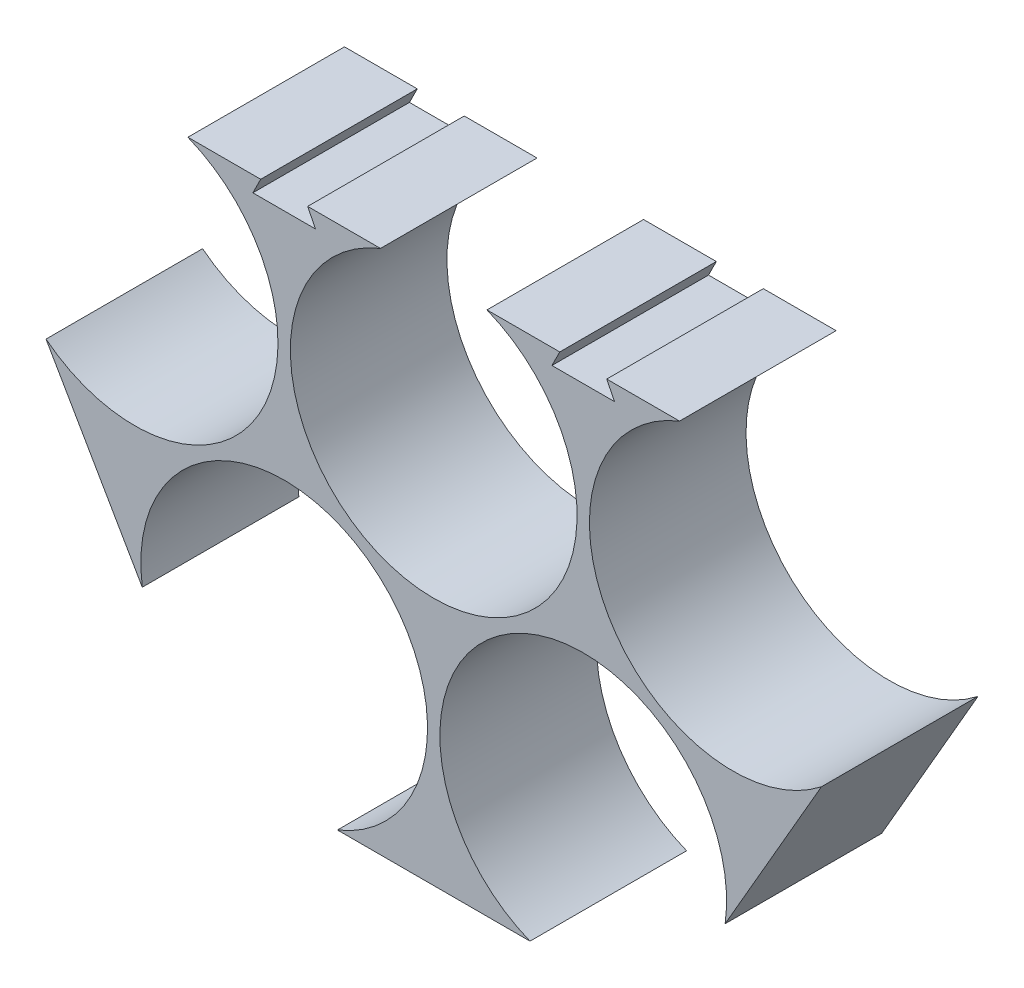
ISO-10303-21;
HEADER;
FILE_DESCRIPTION(('STEP AP214'),'2;1');
FILE_NAME('part.step','',(''),(''),'','','');
FILE_SCHEMA(('AUTOMOTIVE_DESIGN { 1 0 10303 214 1 1 1 1 }'));
ENDSEC;
DATA;
#1=APPLICATION_CONTEXT('core data for automotive mechanical design processes');
#2=APPLICATION_PROTOCOL_DEFINITION('international standard','automotive_design',2000,#1);
#3=PRODUCT_CONTEXT('',#1,'mechanical');
#4=PRODUCT('Part','Part','',(#3));
#5=PRODUCT_RELATED_PRODUCT_CATEGORY('part','',(#4));
#6=PRODUCT_DEFINITION_FORMATION('','',#4);
#7=PRODUCT_DEFINITION_CONTEXT('part definition',#1,'design');
#8=PRODUCT_DEFINITION('design','',#6,#7);
#9=PRODUCT_DEFINITION_SHAPE('','',#8);
#10=(LENGTH_UNIT() NAMED_UNIT(*) SI_UNIT(.MILLI.,.METRE.));
#11=(NAMED_UNIT(*) PLANE_ANGLE_UNIT() SI_UNIT($,.RADIAN.));
#12=(NAMED_UNIT(*) SI_UNIT($,.STERADIAN.) SOLID_ANGLE_UNIT());
#13=UNCERTAINTY_MEASURE_WITH_UNIT(LENGTH_MEASURE(1.E-05),#10,'distance_accuracy_value','');
#14=(GEOMETRIC_REPRESENTATION_CONTEXT(3) GLOBAL_UNCERTAINTY_ASSIGNED_CONTEXT((#13)) GLOBAL_UNIT_ASSIGNED_CONTEXT((#10,
#11,#12)) REPRESENTATION_CONTEXT('',''));
#15=CARTESIAN_POINT('',(0.,0.,0.));
#16=DIRECTION('',(0.,0.,1.));
#17=DIRECTION('',(1.,0.,0.));
#18=AXIS2_PLACEMENT_3D('',#15,#16,#17);
#19=CARTESIAN_POINT('',(0.,1.34473536281053,10.));
#20=DIRECTION('',(0.,1.,0.));
#21=DIRECTION('',(-1.,0.,0.));
#22=AXIS2_PLACEMENT_3D('',#19,#20,#21);
#23=PLANE('',#22);
#24=DIRECTION('',(1.,0.,0.));
#25=VECTOR('',#24,1.);
#26=CARTESIAN_POINT('',(0.,1.34473536281053,0.));
#27=LINE('',#26,#25);
#28=CARTESIAN_POINT('',(-11.4971994161277,1.34473536281053,0.));
#29=VERTEX_POINT('',#28);
#30=CARTESIAN_POINT('',(-6.84779127637798,1.34473536281053,0.));
#31=VERTEX_POINT('',#30);
#32=EDGE_CURVE('E289',#29,#31,#27,.T.);
#33=ORIENTED_EDGE('',*,*,#32,.F.);
#34=DIRECTION('',(0.,0.,-1.));
#35=VECTOR('',#34,1.);
#36=CARTESIAN_POINT('',(-11.4971994161277,1.34473536281053,10.));
#37=LINE('',#36,#35);
#38=CARTESIAN_POINT('',(-11.4971994161277,1.34473536281053,10.));
#39=VERTEX_POINT('',#38);
#40=EDGE_CURVE('E207',#39,#29,#37,.T.);
#41=ORIENTED_EDGE('',*,*,#40,.F.);
#42=DIRECTION('',(1.,0.,0.));
#43=VECTOR('',#42,1.);
#44=CARTESIAN_POINT('',(0.,1.34473536281053,10.));
#45=LINE('',#44,#43);
#46=CARTESIAN_POINT('',(-6.84779127637798,1.34473536281053,10.));
#47=VERTEX_POINT('',#46);
#48=EDGE_CURVE('E248',#39,#47,#45,.T.);
#49=ORIENTED_EDGE('',*,*,#48,.T.);
#50=DIRECTION('',(0.,0.,-1.));
#51=VECTOR('',#50,1.);
#52=CARTESIAN_POINT('',(-6.84779127637798,1.34473536281053,10.));
#53=LINE('',#52,#51);
#54=EDGE_CURVE('E11',#47,#31,#53,.T.);
#55=ORIENTED_EDGE('',*,*,#54,.T.);
#56=EDGE_LOOP('',(#33,#41,#49,#55));
#57=FACE_BOUND('',#56,.T.);
#58=ADVANCED_FACE('F41',(#57),#23,.T.);
#59=CARTESIAN_POINT('',(0.,1.34473536281053,10.));
#60=DIRECTION('',(0.,1.,0.));
#61=DIRECTION('',(-1.,0.,0.));
#62=AXIS2_PLACEMENT_3D('',#59,#60,#61);
#63=PLANE('',#62);
#64=DIRECTION('',(1.,0.,0.));
#65=VECTOR('',#64,1.);
#66=CARTESIAN_POINT('',(0.,1.34473536281053,0.));
#67=LINE('',#66,#65);
#68=CARTESIAN_POINT('',(-30.5971994161277,1.34473536281053,0.));
#69=VERTEX_POINT('',#68);
#70=CARTESIAN_POINT('',(-25.9477912763779,1.34473536281053,0.));
#71=VERTEX_POINT('',#70);
#72=EDGE_CURVE('E298',#69,#71,#67,.T.);
#73=ORIENTED_EDGE('',*,*,#72,.F.);
#74=DIRECTION('',(0.,0.,-1.));
#75=VECTOR('',#74,1.);
#76=CARTESIAN_POINT('',(-30.5971994161277,1.34473536281053,10.));
#77=LINE('',#76,#75);
#78=CARTESIAN_POINT('',(-30.5971994161277,1.34473536281053,10.));
#79=VERTEX_POINT('',#78);
#80=EDGE_CURVE('E200',#79,#69,#77,.T.);
#81=ORIENTED_EDGE('',*,*,#80,.F.);
#82=DIRECTION('',(1.,0.,0.));
#83=VECTOR('',#82,1.);
#84=CARTESIAN_POINT('',(0.,1.34473536281053,10.));
#85=LINE('',#84,#83);
#86=CARTESIAN_POINT('',(-25.9477912763779,1.34473536281053,10.));
#87=VERTEX_POINT('',#86);
#88=EDGE_CURVE('E257',#79,#87,#85,.T.);
#89=ORIENTED_EDGE('',*,*,#88,.T.);
#90=DIRECTION('',(0.,0.,-1.));
#91=VECTOR('',#90,1.);
#92=CARTESIAN_POINT('',(-25.9477912763779,1.34473536281053,10.));
#93=LINE('',#92,#91);
#94=EDGE_CURVE('E346',#87,#71,#93,.T.);
#95=ORIENTED_EDGE('',*,*,#94,.T.);
#96=EDGE_LOOP('',(#73,#81,#89,#95));
#97=FACE_BOUND('',#96,.T.);
#98=ADVANCED_FACE('F365',(#97),#63,.T.);
#99=CARTESIAN_POINT('',(0.,0.,10.));
#100=DIRECTION('',(0.,0.,1.));
#101=DIRECTION('',(1.,0.,0.));
#102=AXIS2_PLACEMENT_3D('',#99,#100,#101);
#103=PLANE('',#102);
#104=ORIENTED_EDGE('',*,*,#48,.F.);
#105=DIRECTION('',(-0.447213595499958,0.894427190999916,0.));
#106=VECTOR('',#105,1.);
#107=CARTESIAN_POINT('',(-8.65986538777798,-4.32993269388899,10.));
#108=LINE('',#107,#106);
#109=CARTESIAN_POINT('',(-10.9971994161277,0.344735362810525,10.));
#110=VERTEX_POINT('',#109);
#111=EDGE_CURVE('E175',#110,#39,#108,.T.);
#112=ORIENTED_EDGE('',*,*,#111,.F.);
#113=DIRECTION('',(-1.,0.,0.));
#114=VECTOR('',#113,1.);
#115=CARTESIAN_POINT('',(0.,0.344735362810523,10.));
#116=LINE('',#115,#114);
#117=CARTESIAN_POINT('',(-14.9971994161277,0.344735362810526,10.));
#118=VERTEX_POINT('',#117);
#119=EDGE_CURVE('E169',#110,#118,#116,.T.);
#120=ORIENTED_EDGE('',*,*,#119,.T.);
#121=DIRECTION('',(0.447213595499958,0.894427190999916,0.));
#122=VECTOR('',#121,1.);
#123=CARTESIAN_POINT('',(-12.1356536780264,6.0678268390132,10.));
#124=LINE('',#123,#122);
#125=CARTESIAN_POINT('',(-14.4971994161277,1.34473536281053,10.));
#126=VERTEX_POINT('',#125);
#127=EDGE_CURVE('E178',#118,#126,#124,.T.);
#128=ORIENTED_EDGE('',*,*,#127,.T.);
#129=CARTESIAN_POINT('',(-19.1466075558775,1.34473536281052,10.));
#130=VERTEX_POINT('',#129);
#131=EDGE_CURVE('E250',#130,#126,#45,.T.);
#132=ORIENTED_EDGE('',*,*,#131,.F.);
#133=CARTESIAN_POINT('',(-22.5471994161277,-7.15526463718948,10.));
#134=DIRECTION('',(0.,0.,1.));
#135=DIRECTION('',(1.,0.,0.));
#136=AXIS2_PLACEMENT_3D('',#133,#134,#135);
#137=CIRCLE('',#136,9.155);
#138=EDGE_CURVE('E253',#87,#130,#137,.T.);
#139=ORIENTED_EDGE('',*,*,#138,.F.);
#140=ORIENTED_EDGE('',*,*,#88,.F.);
#141=DIRECTION('',(-0.447213595499958,0.894427190999916,0.));
#142=VECTOR('',#141,1.);
#143=CARTESIAN_POINT('',(-23.9398653877779,-11.969932693889,10.));
#144=LINE('',#143,#142);
#145=CARTESIAN_POINT('',(-30.0971994161277,0.344735362810526,10.));
#146=VERTEX_POINT('',#145);
#147=EDGE_CURVE('E212',#146,#79,#144,.T.);
#148=ORIENTED_EDGE('',*,*,#147,.F.);
#149=DIRECTION('',(-1.,0.,0.));
#150=VECTOR('',#149,1.);
#151=CARTESIAN_POINT('',(0.,0.344735362810526,10.));
#152=LINE('',#151,#150);
#153=CARTESIAN_POINT('',(-34.0971994161277,0.344735362810526,10.));
#154=VERTEX_POINT('',#153);
#155=EDGE_CURVE('E215',#146,#154,#152,.T.);
#156=ORIENTED_EDGE('',*,*,#155,.T.);
#157=DIRECTION('',(0.447213595499958,0.894427190999916,0.));
#158=VECTOR('',#157,1.);
#159=CARTESIAN_POINT('',(-27.4156536780263,13.7078268390132,10.));
#160=LINE('',#159,#158);
#161=CARTESIAN_POINT('',(-33.5971994161277,1.34473536281053,10.));
#162=VERTEX_POINT('',#161);
#163=EDGE_CURVE('E220',#154,#162,#160,.T.);
#164=ORIENTED_EDGE('',*,*,#163,.T.);
#165=CARTESIAN_POINT('',(-38.2466075558774,1.34473536281052,10.));
#166=VERTEX_POINT('',#165);
#167=EDGE_CURVE('E258',#166,#162,#85,.T.);
#168=ORIENTED_EDGE('',*,*,#167,.F.);
#169=CARTESIAN_POINT('',(-41.6471994161276,-7.15526463718948,10.));
#170=DIRECTION('',(0.,0.,1.));
#171=DIRECTION('',(1.,0.,0.));
#172=AXIS2_PLACEMENT_3D('',#169,#170,#171);
#173=CIRCLE('',#172,9.15499999999999);
#174=CARTESIAN_POINT('',(-47.3081194181702,-14.3502635760687,10.));
#175=VERTEX_POINT('',#174);
#176=EDGE_CURVE('E262',#175,#166,#173,.T.);
#177=ORIENTED_EDGE('',*,*,#176,.F.);
#178=DIRECTION('',(-0.499999999999998,0.86602540378444,0.));
#179=VECTOR('',#178,1.);
#180=CARTESIAN_POINT('',(-41.6949359675668,-24.0725825047188,10.));
#181=LINE('',#180,#179);
#182=CARTESIAN_POINT('',(-41.1587112784205,-25.001350910593,10.));
#183=VERTEX_POINT('',#182);
#184=EDGE_CURVE('E266',#183,#175,#181,.T.);
#185=ORIENTED_EDGE('',*,*,#184,.F.);
#186=CARTESIAN_POINT('',(-32.0971994161277,-23.6963498494723,10.));
#187=DIRECTION('',(0.,0.,1.));
#188=DIRECTION('',(1.,0.,0.));
#189=AXIS2_PLACEMENT_3D('',#186,#187,#188);
#190=CIRCLE('',#189,9.15500000000001);
#191=CARTESIAN_POINT('',(-28.6966075558775,-32.1963498494723,10.));
#192=VERTEX_POINT('',#191);
#193=EDGE_CURVE('E270',#192,#183,#190,.T.);
#194=ORIENTED_EDGE('',*,*,#193,.F.);
#195=DIRECTION('',(-1.,0.,0.));
#196=VECTOR('',#195,1.);
#197=CARTESIAN_POINT('',(0.,-32.1963498494723,10.));
#198=LINE('',#197,#196);
#199=CARTESIAN_POINT('',(-16.3977912763779,-32.1963498494723,10.));
#200=VERTEX_POINT('',#199);
#201=EDGE_CURVE('E274',#200,#192,#198,.T.);
#202=ORIENTED_EDGE('',*,*,#201,.F.);
#203=CARTESIAN_POINT('',(-12.9971994161277,-23.6963498494723,10.));
#204=DIRECTION('',(0.,0.,1.));
#205=DIRECTION('',(1.,0.,0.));
#206=AXIS2_PLACEMENT_3D('',#203,#204,#205);
#207=CIRCLE('',#206,9.15500000000002);
#208=CARTESIAN_POINT('',(-3.9356875538349,-25.001350910593,10.));
#209=VERTEX_POINT('',#208);
#210=EDGE_CURVE('E278',#209,#200,#207,.T.);
#211=ORIENTED_EDGE('',*,*,#210,.F.);
#212=DIRECTION('',(0.499999999999998,0.86602540378444,0.));
#213=VECTOR('',#212,1.);
#214=CARTESIAN_POINT('',(7.87413684337514,-4.54613502615856,10.));
#215=LINE('',#214,#213);
#216=CARTESIAN_POINT('',(2.21372058591484,-14.3502635760687,10.));
#217=VERTEX_POINT('',#216);
#218=EDGE_CURVE('E282',#209,#217,#215,.T.);
#219=ORIENTED_EDGE('',*,*,#218,.T.);
#220=CARTESIAN_POINT('',(-3.44719941612778,-7.15526463718948,10.));
#221=DIRECTION('',(0.,0.,1.));
#222=DIRECTION('',(1.,0.,0.));
#223=AXIS2_PLACEMENT_3D('',#220,#221,#222);
#224=CIRCLE('',#223,9.15499999999999);
#225=EDGE_CURVE('E244',#47,#217,#224,.T.);
#226=ORIENTED_EDGE('',*,*,#225,.F.);
#227=EDGE_LOOP('',(#104,#112,#120,#128,#132,#139,#140,#148,#156,#164,#168,#177,#185,#194,#202,
#211,#219,#226));
#228=FACE_BOUND('',#227,.T.);
#229=ADVANCED_FACE('F187',(#228),#103,.T.);
#230=CARTESIAN_POINT('',(0.,0.,0.));
#231=DIRECTION('',(0.,0.,1.));
#232=DIRECTION('',(1.,0.,0.));
#233=AXIS2_PLACEMENT_3D('',#230,#231,#232);
#234=PLANE('',#233);
#235=DIRECTION('',(-0.447213595499958,0.894427190999916,0.));
#236=VECTOR('',#235,1.);
#237=CARTESIAN_POINT('',(-8.65986538777798,-4.32993269388899,0.));
#238=LINE('',#237,#236);
#239=CARTESIAN_POINT('',(-10.9971994161277,0.344735362810525,0.));
#240=VERTEX_POINT('',#239);
#241=EDGE_CURVE('E189',#240,#29,#238,.T.);
#242=ORIENTED_EDGE('',*,*,#241,.T.);
#243=ORIENTED_EDGE('',*,*,#32,.T.);
#244=CARTESIAN_POINT('',(-3.44719941612778,-7.15526463718948,0.));
#245=DIRECTION('',(0.,0.,1.));
#246=DIRECTION('',(1.,0.,0.));
#247=AXIS2_PLACEMENT_3D('',#244,#245,#246);
#248=CIRCLE('',#247,9.15499999999999);
#249=CARTESIAN_POINT('',(2.21372058591484,-14.3502635760687,0.));
#250=VERTEX_POINT('',#249);
#251=EDGE_CURVE('E206',#31,#250,#248,.T.);
#252=ORIENTED_EDGE('',*,*,#251,.T.);
#253=DIRECTION('',(0.499999999999998,0.86602540378444,0.));
#254=VECTOR('',#253,1.);
#255=CARTESIAN_POINT('',(7.87413684337514,-4.54613502615856,0.));
#256=LINE('',#255,#254);
#257=CARTESIAN_POINT('',(-3.9356875538349,-25.001350910593,0.));
#258=VERTEX_POINT('',#257);
#259=EDGE_CURVE('E249',#258,#250,#256,.T.);
#260=ORIENTED_EDGE('',*,*,#259,.F.);
#261=CARTESIAN_POINT('',(-12.9971994161277,-23.6963498494723,0.));
#262=DIRECTION('',(0.,0.,1.));
#263=DIRECTION('',(1.,0.,0.));
#264=AXIS2_PLACEMENT_3D('',#261,#262,#263);
#265=CIRCLE('',#264,9.15500000000002);
#266=CARTESIAN_POINT('',(-16.3977912763779,-32.1963498494723,0.));
#267=VERTEX_POINT('',#266);
#268=EDGE_CURVE('E319',#258,#267,#265,.T.);
#269=ORIENTED_EDGE('',*,*,#268,.T.);
#270=DIRECTION('',(-1.,0.,0.));
#271=VECTOR('',#270,1.);
#272=CARTESIAN_POINT('',(0.,-32.1963498494723,0.));
#273=LINE('',#272,#271);
#274=CARTESIAN_POINT('',(-28.6966075558775,-32.1963498494723,0.));
#275=VERTEX_POINT('',#274);
#276=EDGE_CURVE('E315',#267,#275,#273,.T.);
#277=ORIENTED_EDGE('',*,*,#276,.T.);
#278=CARTESIAN_POINT('',(-32.0971994161277,-23.6963498494723,0.));
#279=DIRECTION('',(0.,0.,1.));
#280=DIRECTION('',(1.,0.,0.));
#281=AXIS2_PLACEMENT_3D('',#278,#279,#280);
#282=CIRCLE('',#281,9.15500000000001);
#283=CARTESIAN_POINT('',(-41.1587112784205,-25.001350910593,0.));
#284=VERTEX_POINT('',#283);
#285=EDGE_CURVE('E311',#275,#284,#282,.T.);
#286=ORIENTED_EDGE('',*,*,#285,.T.);
#287=DIRECTION('',(-0.499999999999998,0.86602540378444,0.));
#288=VECTOR('',#287,1.);
#289=CARTESIAN_POINT('',(-41.6949359675668,-24.0725825047188,0.));
#290=LINE('',#289,#288);
#291=CARTESIAN_POINT('',(-47.3081194181702,-14.3502635760687,0.));
#292=VERTEX_POINT('',#291);
#293=EDGE_CURVE('E307',#284,#292,#290,.T.);
#294=ORIENTED_EDGE('',*,*,#293,.T.);
#295=CARTESIAN_POINT('',(-41.6471994161276,-7.15526463718948,0.));
#296=DIRECTION('',(0.,0.,1.));
#297=DIRECTION('',(1.,0.,0.));
#298=AXIS2_PLACEMENT_3D('',#295,#296,#297);
#299=CIRCLE('',#298,9.15499999999999);
#300=CARTESIAN_POINT('',(-38.2466075558774,1.34473536281052,0.));
#301=VERTEX_POINT('',#300);
#302=EDGE_CURVE('E303',#292,#301,#299,.T.);
#303=ORIENTED_EDGE('',*,*,#302,.T.);
#304=CARTESIAN_POINT('',(-33.5971994161277,1.34473536281053,0.));
#305=VERTEX_POINT('',#304);
#306=EDGE_CURVE('E299',#301,#305,#67,.T.);
#307=ORIENTED_EDGE('',*,*,#306,.T.);
#308=DIRECTION('',(0.447213595499958,0.894427190999916,0.));
#309=VECTOR('',#308,1.);
#310=CARTESIAN_POINT('',(-27.4156536780263,13.7078268390132,0.));
#311=LINE('',#310,#309);
#312=CARTESIAN_POINT('',(-34.0971994161277,0.344735362810526,0.));
#313=VERTEX_POINT('',#312);
#314=EDGE_CURVE('E216',#313,#305,#311,.T.);
#315=ORIENTED_EDGE('',*,*,#314,.F.);
#316=DIRECTION('',(-1.,0.,0.));
#317=VECTOR('',#316,1.);
#318=CARTESIAN_POINT('',(0.,0.344735362810526,0.));
#319=LINE('',#318,#317);
#320=CARTESIAN_POINT('',(-30.0971994161277,0.344735362810526,0.));
#321=VERTEX_POINT('',#320);
#322=EDGE_CURVE('E227',#321,#313,#319,.T.);
#323=ORIENTED_EDGE('',*,*,#322,.F.);
#324=DIRECTION('',(-0.447213595499958,0.894427190999916,0.));
#325=VECTOR('',#324,1.);
#326=CARTESIAN_POINT('',(-23.9398653877779,-11.969932693889,0.));
#327=LINE('',#326,#325);
#328=EDGE_CURVE('E65',#321,#69,#327,.T.);
#329=ORIENTED_EDGE('',*,*,#328,.T.);
#330=ORIENTED_EDGE('',*,*,#72,.T.);
#331=CARTESIAN_POINT('',(-22.5471994161277,-7.15526463718948,0.));
#332=DIRECTION('',(0.,0.,1.));
#333=DIRECTION('',(1.,0.,0.));
#334=AXIS2_PLACEMENT_3D('',#331,#332,#333);
#335=CIRCLE('',#334,9.155);
#336=CARTESIAN_POINT('',(-19.1466075558775,1.34473536281052,0.));
#337=VERTEX_POINT('',#336);
#338=EDGE_CURVE('E294',#71,#337,#335,.T.);
#339=ORIENTED_EDGE('',*,*,#338,.T.);
#340=CARTESIAN_POINT('',(-14.4971994161277,1.34473536281053,0.));
#341=VERTEX_POINT('',#340);
#342=EDGE_CURVE('E290',#337,#341,#27,.T.);
#343=ORIENTED_EDGE('',*,*,#342,.T.);
#344=DIRECTION('',(0.447213595499958,0.894427190999916,0.));
#345=VECTOR('',#344,1.);
#346=CARTESIAN_POINT('',(-12.1356536780264,6.0678268390132,0.));
#347=LINE('',#346,#345);
#348=CARTESIAN_POINT('',(-14.9971994161277,0.344735362810526,0.));
#349=VERTEX_POINT('',#348);
#350=EDGE_CURVE('E193',#349,#341,#347,.T.);
#351=ORIENTED_EDGE('',*,*,#350,.F.);
#352=DIRECTION('',(-1.,0.,0.));
#353=VECTOR('',#352,1.);
#354=CARTESIAN_POINT('',(0.,0.344735362810523,0.));
#355=LINE('',#354,#353);
#356=EDGE_CURVE('E57',#240,#349,#355,.T.);
#357=ORIENTED_EDGE('',*,*,#356,.F.);
#358=EDGE_LOOP('',(#242,#243,#252,#260,#269,#277,#286,#294,#303,#307,#315,#323,#329,#330,#339,
#343,#351,#357));
#359=FACE_BOUND('',#358,.T.);
#360=ADVANCED_FACE('F359',(#359),#234,.F.);
#361=CARTESIAN_POINT('',(-3.44719941612778,-7.15526463718948,10.));
#362=DIRECTION('',(0.,0.,-1.));
#363=DIRECTION('',(-1.,0.,0.));
#364=AXIS2_PLACEMENT_3D('',#361,#362,#363);
#365=CYLINDRICAL_SURFACE('',#364,9.15499999999999);
#366=ORIENTED_EDGE('',*,*,#251,.F.);
#367=ORIENTED_EDGE('',*,*,#54,.F.);
#368=ORIENTED_EDGE('',*,*,#225,.T.);
#369=DIRECTION('',(0.,0.,-1.));
#370=VECTOR('',#369,1.);
#371=CARTESIAN_POINT('',(2.21372058591484,-14.3502635760687,10.));
#372=LINE('',#371,#370);
#373=EDGE_CURVE('E285',#217,#250,#372,.T.);
#374=ORIENTED_EDGE('',*,*,#373,.T.);
#375=EDGE_LOOP('',(#366,#367,#368,#374));
#376=FACE_BOUND('',#375,.T.);
#377=ADVANCED_FACE('F43',(#376),#365,.F.);
#378=DIRECTION('',(0.,0.,-1.));
#379=VECTOR('',#378,1.);
#380=CARTESIAN_POINT('',(-14.4971994161277,1.34473536281053,10.));
#381=LINE('',#380,#379);
#382=EDGE_CURVE('E174',#126,#341,#381,.T.);
#383=ORIENTED_EDGE('',*,*,#382,.T.);
#384=ORIENTED_EDGE('',*,*,#342,.F.);
#385=DIRECTION('',(0.,0.,-1.));
#386=VECTOR('',#385,1.);
#387=CARTESIAN_POINT('',(-19.1466075558775,1.34473536281052,10.));
#388=LINE('',#387,#386);
#389=EDGE_CURVE('E50',#130,#337,#388,.T.);
#390=ORIENTED_EDGE('',*,*,#389,.F.);
#391=ORIENTED_EDGE('',*,*,#131,.T.);
#392=EDGE_LOOP('',(#383,#384,#390,#391));
#393=FACE_BOUND('',#392,.T.);
#394=ADVANCED_FACE('F357',(#393),#23,.T.);
#395=CARTESIAN_POINT('',(-22.5471994161277,-7.15526463718948,10.));
#396=DIRECTION('',(0.,0.,-1.));
#397=DIRECTION('',(-1.,0.,0.));
#398=AXIS2_PLACEMENT_3D('',#395,#396,#397);
#399=CYLINDRICAL_SURFACE('',#398,9.155);
#400=ORIENTED_EDGE('',*,*,#338,.F.);
#401=ORIENTED_EDGE('',*,*,#94,.F.);
#402=ORIENTED_EDGE('',*,*,#138,.T.);
#403=ORIENTED_EDGE('',*,*,#389,.T.);
#404=EDGE_LOOP('',(#400,#401,#402,#403));
#405=FACE_BOUND('',#404,.T.);
#406=ADVANCED_FACE('F353',(#405),#399,.F.);
#407=DIRECTION('',(0.,0.,-1.));
#408=VECTOR('',#407,1.);
#409=CARTESIAN_POINT('',(-33.5971994161277,1.34473536281053,10.));
#410=LINE('',#409,#408);
#411=EDGE_CURVE('E235',#162,#305,#410,.T.);
#412=ORIENTED_EDGE('',*,*,#411,.T.);
#413=ORIENTED_EDGE('',*,*,#306,.F.);
#414=DIRECTION('',(0.,0.,-1.));
#415=VECTOR('',#414,1.);
#416=CARTESIAN_POINT('',(-38.2466075558774,1.34473536281052,10.));
#417=LINE('',#416,#415);
#418=EDGE_CURVE('E343',#166,#301,#417,.T.);
#419=ORIENTED_EDGE('',*,*,#418,.F.);
#420=ORIENTED_EDGE('',*,*,#167,.T.);
#421=EDGE_LOOP('',(#412,#413,#419,#420));
#422=FACE_BOUND('',#421,.T.);
#423=ADVANCED_FACE('F407',(#422),#63,.T.);
#424=CARTESIAN_POINT('',(-41.6471994161276,-7.15526463718948,10.));
#425=DIRECTION('',(0.,0.,-1.));
#426=DIRECTION('',(-1.,0.,0.));
#427=AXIS2_PLACEMENT_3D('',#424,#425,#426);
#428=CYLINDRICAL_SURFACE('',#427,9.15499999999999);
#429=ORIENTED_EDGE('',*,*,#302,.F.);
#430=DIRECTION('',(0.,0.,-1.));
#431=VECTOR('',#430,1.);
#432=CARTESIAN_POINT('',(-47.3081194181702,-14.3502635760687,10.));
#433=LINE('',#432,#431);
#434=EDGE_CURVE('E340',#175,#292,#433,.T.);
#435=ORIENTED_EDGE('',*,*,#434,.F.);
#436=ORIENTED_EDGE('',*,*,#176,.T.);
#437=ORIENTED_EDGE('',*,*,#418,.T.);
#438=EDGE_LOOP('',(#429,#435,#436,#437));
#439=FACE_BOUND('',#438,.T.);
#440=ADVANCED_FACE('F403',(#439),#428,.F.);
#441=CARTESIAN_POINT('',(-41.6949359675668,-24.0725825047188,10.));
#442=DIRECTION('',(-0.86602540378444,-0.499999999999998,0.));
#443=DIRECTION('',(0.499999999999998,-0.86602540378444,0.));
#444=AXIS2_PLACEMENT_3D('',#441,#442,#443);
#445=PLANE('',#444);
#446=ORIENTED_EDGE('',*,*,#293,.F.);
#447=DIRECTION('',(0.,0.,-1.));
#448=VECTOR('',#447,1.);
#449=CARTESIAN_POINT('',(-41.1587112784205,-25.001350910593,10.));
#450=LINE('',#449,#448);
#451=EDGE_CURVE('E337',#183,#284,#450,.T.);
#452=ORIENTED_EDGE('',*,*,#451,.F.);
#453=ORIENTED_EDGE('',*,*,#184,.T.);
#454=ORIENTED_EDGE('',*,*,#434,.T.);
#455=EDGE_LOOP('',(#446,#452,#453,#454));
#456=FACE_BOUND('',#455,.T.);
#457=ADVANCED_FACE('F399',(#456),#445,.T.);
#458=CARTESIAN_POINT('',(-32.0971994161277,-23.6963498494723,10.));
#459=DIRECTION('',(0.,0.,-1.));
#460=DIRECTION('',(-1.,0.,0.));
#461=AXIS2_PLACEMENT_3D('',#458,#459,#460);
#462=CYLINDRICAL_SURFACE('',#461,9.15500000000001);
#463=ORIENTED_EDGE('',*,*,#285,.F.);
#464=DIRECTION('',(0.,0.,-1.));
#465=VECTOR('',#464,1.);
#466=CARTESIAN_POINT('',(-28.6966075558775,-32.1963498494723,10.));
#467=LINE('',#466,#465);
#468=EDGE_CURVE('E334',#192,#275,#467,.T.);
#469=ORIENTED_EDGE('',*,*,#468,.F.);
#470=ORIENTED_EDGE('',*,*,#193,.T.);
#471=ORIENTED_EDGE('',*,*,#451,.T.);
#472=EDGE_LOOP('',(#463,#469,#470,#471));
#473=FACE_BOUND('',#472,.T.);
#474=ADVANCED_FACE('F395',(#473),#462,.F.);
#475=CARTESIAN_POINT('',(0.,-32.1963498494723,10.));
#476=DIRECTION('',(0.,-1.,0.));
#477=DIRECTION('',(1.,0.,0.));
#478=AXIS2_PLACEMENT_3D('',#475,#476,#477);
#479=PLANE('',#478);
#480=ORIENTED_EDGE('',*,*,#276,.F.);
#481=DIRECTION('',(0.,0.,-1.));
#482=VECTOR('',#481,1.);
#483=CARTESIAN_POINT('',(-16.3977912763779,-32.1963498494723,10.));
#484=LINE('',#483,#482);
#485=EDGE_CURVE('E331',#200,#267,#484,.T.);
#486=ORIENTED_EDGE('',*,*,#485,.F.);
#487=ORIENTED_EDGE('',*,*,#201,.T.);
#488=ORIENTED_EDGE('',*,*,#468,.T.);
#489=EDGE_LOOP('',(#480,#486,#487,#488));
#490=FACE_BOUND('',#489,.T.);
#491=ADVANCED_FACE('F391',(#490),#479,.T.);
#492=CARTESIAN_POINT('',(-12.9971994161277,-23.6963498494723,10.));
#493=DIRECTION('',(0.,0.,-1.));
#494=DIRECTION('',(-1.,0.,0.));
#495=AXIS2_PLACEMENT_3D('',#492,#493,#494);
#496=CYLINDRICAL_SURFACE('',#495,9.15500000000002);
#497=ORIENTED_EDGE('',*,*,#268,.F.);
#498=DIRECTION('',(0.,0.,-1.));
#499=VECTOR('',#498,1.);
#500=CARTESIAN_POINT('',(-3.9356875538349,-25.001350910593,10.));
#501=LINE('',#500,#499);
#502=EDGE_CURVE('E328',#209,#258,#501,.T.);
#503=ORIENTED_EDGE('',*,*,#502,.F.);
#504=ORIENTED_EDGE('',*,*,#210,.T.);
#505=ORIENTED_EDGE('',*,*,#485,.T.);
#506=EDGE_LOOP('',(#497,#503,#504,#505));
#507=FACE_BOUND('',#506,.T.);
#508=ADVANCED_FACE('F386',(#507),#496,.F.);
#509=CARTESIAN_POINT('',(7.87413684337514,-4.54613502615856,10.));
#510=DIRECTION('',(-0.86602540378444,0.499999999999998,0.));
#511=DIRECTION('',(-0.499999999999998,-0.86602540378444,0.));
#512=AXIS2_PLACEMENT_3D('',#509,#510,#511);
#513=PLANE('',#512);
#514=ORIENTED_EDGE('',*,*,#259,.T.);
#515=ORIENTED_EDGE('',*,*,#373,.F.);
#516=ORIENTED_EDGE('',*,*,#218,.F.);
#517=ORIENTED_EDGE('',*,*,#502,.T.);
#518=EDGE_LOOP('',(#514,#515,#516,#517));
#519=FACE_BOUND('',#518,.T.);
#520=ADVANCED_FACE('F383',(#519),#513,.F.);
#521=CARTESIAN_POINT('',(-23.9398653877779,-11.969932693889,10.));
#522=DIRECTION('',(-0.894427190999916,-0.447213595499958,0.));
#523=DIRECTION('',(0.447213595499958,-0.894427190999916,0.));
#524=AXIS2_PLACEMENT_3D('',#521,#522,#523);
#525=PLANE('',#524);
#526=ORIENTED_EDGE('',*,*,#328,.F.);
#527=DIRECTION('',(0.,0.,-1.));
#528=VECTOR('',#527,1.);
#529=CARTESIAN_POINT('',(-30.0971994161277,0.344735362810526,10.));
#530=LINE('',#529,#528);
#531=EDGE_CURVE('E224',#146,#321,#530,.T.);
#532=ORIENTED_EDGE('',*,*,#531,.F.);
#533=ORIENTED_EDGE('',*,*,#147,.T.);
#534=ORIENTED_EDGE('',*,*,#80,.T.);
#535=EDGE_LOOP('',(#526,#532,#533,#534));
#536=FACE_BOUND('',#535,.T.);
#537=ADVANCED_FACE('F415',(#536),#525,.T.);
#538=CARTESIAN_POINT('',(-27.4156536780263,13.7078268390132,10.));
#539=DIRECTION('',(-0.894427190999916,0.447213595499958,0.));
#540=DIRECTION('',(-0.447213595499958,-0.894427190999916,0.));
#541=AXIS2_PLACEMENT_3D('',#538,#539,#540);
#542=PLANE('',#541);
#543=ORIENTED_EDGE('',*,*,#314,.T.);
#544=ORIENTED_EDGE('',*,*,#411,.F.);
#545=ORIENTED_EDGE('',*,*,#163,.F.);
#546=DIRECTION('',(0.,0.,-1.));
#547=VECTOR('',#546,1.);
#548=CARTESIAN_POINT('',(-34.0971994161277,0.344735362810526,10.));
#549=LINE('',#548,#547);
#550=EDGE_CURVE('E239',#154,#313,#549,.T.);
#551=ORIENTED_EDGE('',*,*,#550,.T.);
#552=EDGE_LOOP('',(#543,#544,#545,#551));
#553=FACE_BOUND('',#552,.T.);
#554=ADVANCED_FACE('F411',(#553),#542,.F.);
#555=CARTESIAN_POINT('',(0.,0.344735362810526,10.));
#556=DIRECTION('',(0.,-1.,0.));
#557=DIRECTION('',(0.,0.,-1.));
#558=AXIS2_PLACEMENT_3D('',#555,#556,#557);
#559=PLANE('',#558);
#560=ORIENTED_EDGE('',*,*,#322,.T.);
#561=ORIENTED_EDGE('',*,*,#550,.F.);
#562=ORIENTED_EDGE('',*,*,#155,.F.);
#563=ORIENTED_EDGE('',*,*,#531,.T.);
#564=EDGE_LOOP('',(#560,#561,#562,#563));
#565=FACE_BOUND('',#564,.T.);
#566=ADVANCED_FACE('F414',(#565),#559,.F.);
#567=CARTESIAN_POINT('',(0.,0.344735362810523,10.));
#568=DIRECTION('',(0.,-1.,0.));
#569=DIRECTION('',(1.,0.,0.));
#570=AXIS2_PLACEMENT_3D('',#567,#568,#569);
#571=PLANE('',#570);
#572=ORIENTED_EDGE('',*,*,#356,.T.);
#573=DIRECTION('',(0.,0.,-1.));
#574=VECTOR('',#573,1.);
#575=CARTESIAN_POINT('',(-14.9971994161277,0.344735362810526,10.));
#576=LINE('',#575,#574);
#577=EDGE_CURVE('E165',#118,#349,#576,.T.);
#578=ORIENTED_EDGE('',*,*,#577,.F.);
#579=ORIENTED_EDGE('',*,*,#119,.F.);
#580=DIRECTION('',(0.,0.,-1.));
#581=VECTOR('',#580,1.);
#582=CARTESIAN_POINT('',(-10.9971994161277,0.344735362810525,10.));
#583=LINE('',#582,#581);
#584=EDGE_CURVE('E203',#110,#240,#583,.T.);
#585=ORIENTED_EDGE('',*,*,#584,.T.);
#586=EDGE_LOOP('',(#572,#578,#579,#585));
#587=FACE_BOUND('',#586,.T.);
#588=ADVANCED_FACE('F167',(#587),#571,.F.);
#589=CARTESIAN_POINT('',(-8.65986538777798,-4.32993269388899,10.));
#590=DIRECTION('',(-0.894427190999916,-0.447213595499958,0.));
#591=DIRECTION('',(0.447213595499958,-0.894427190999916,0.));
#592=AXIS2_PLACEMENT_3D('',#589,#590,#591);
#593=PLANE('',#592);
#594=ORIENTED_EDGE('',*,*,#241,.F.);
#595=ORIENTED_EDGE('',*,*,#584,.F.);
#596=ORIENTED_EDGE('',*,*,#111,.T.);
#597=ORIENTED_EDGE('',*,*,#40,.T.);
#598=EDGE_LOOP('',(#594,#595,#596,#597));
#599=FACE_BOUND('',#598,.T.);
#600=ADVANCED_FACE('F624',(#599),#593,.T.);
#601=CARTESIAN_POINT('',(-12.1356536780264,6.0678268390132,10.));
#602=DIRECTION('',(-0.894427190999916,0.447213595499958,0.));
#603=DIRECTION('',(-0.447213595499958,-0.894427190999916,0.));
#604=AXIS2_PLACEMENT_3D('',#601,#602,#603);
#605=PLANE('',#604);
#606=ORIENTED_EDGE('',*,*,#350,.T.);
#607=ORIENTED_EDGE('',*,*,#382,.F.);
#608=ORIENTED_EDGE('',*,*,#127,.F.);
#609=ORIENTED_EDGE('',*,*,#577,.T.);
#610=EDGE_LOOP('',(#606,#607,#608,#609));
#611=FACE_BOUND('',#610,.T.);
#612=ADVANCED_FACE('F179',(#611),#605,.F.);
#613=CLOSED_SHELL('',(#58,#98,#229,#360,#377,#394,#406,#423,#440,#457,#474,#491,#508,#520,#537,
#554,#566,#588,#600,#612));
#614=MANIFOLD_SOLID_BREP('B2',#613);
#615=ADVANCED_BREP_SHAPE_REPRESENTATION('',(#18,#614),#14);
#616=SHAPE_DEFINITION_REPRESENTATION(#9,#615);
ENDSEC;
END-ISO-10303-21;
